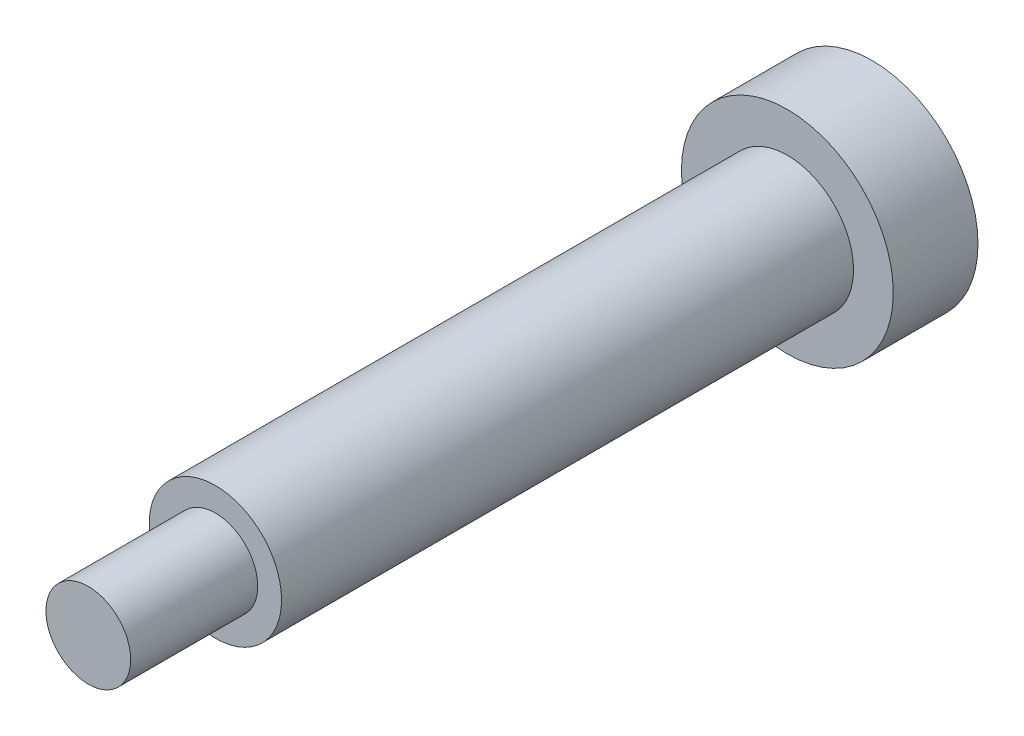
ISO-10303-21;
HEADER;
FILE_DESCRIPTION(('STEP AP214'),'2;1');
FILE_NAME('part.step','',(''),(''),'','','');
FILE_SCHEMA(('AUTOMOTIVE_DESIGN { 1 0 10303 214 1 1 1 1 }'));
ENDSEC;
DATA;
#1=APPLICATION_CONTEXT('core data for automotive mechanical design processes');
#2=APPLICATION_PROTOCOL_DEFINITION('international standard','automotive_design',2000,#1);
#3=PRODUCT_CONTEXT('',#1,'mechanical');
#4=PRODUCT('Part','Part','',(#3));
#5=PRODUCT_RELATED_PRODUCT_CATEGORY('part','',(#4));
#6=PRODUCT_DEFINITION_FORMATION('','',#4);
#7=PRODUCT_DEFINITION_CONTEXT('part definition',#1,'design');
#8=PRODUCT_DEFINITION('design','',#6,#7);
#9=PRODUCT_DEFINITION_SHAPE('','',#8);
#10=(LENGTH_UNIT() NAMED_UNIT(*) SI_UNIT(.MILLI.,.METRE.));
#11=(NAMED_UNIT(*) PLANE_ANGLE_UNIT() SI_UNIT($,.RADIAN.));
#12=(NAMED_UNIT(*) SI_UNIT($,.STERADIAN.) SOLID_ANGLE_UNIT());
#13=UNCERTAINTY_MEASURE_WITH_UNIT(LENGTH_MEASURE(1.E-05),#10,'distance_accuracy_value','');
#14=(GEOMETRIC_REPRESENTATION_CONTEXT(3) GLOBAL_UNCERTAINTY_ASSIGNED_CONTEXT((#13)) GLOBAL_UNIT_ASSIGNED_CONTEXT((#10,
#11,#12)) REPRESENTATION_CONTEXT('',''));
#15=CARTESIAN_POINT('',(0.,0.,0.));
#16=DIRECTION('',(0.,0.,1.));
#17=DIRECTION('',(1.,0.,0.));
#18=AXIS2_PLACEMENT_3D('',#15,#16,#17);
#19=CARTESIAN_POINT('',(0.,0.,4.));
#20=DIRECTION('',(0.,0.,-1.));
#21=DIRECTION('',(-1.,0.,0.));
#22=AXIS2_PLACEMENT_3D('',#19,#20,#21);
#23=CYLINDRICAL_SURFACE('',#22,5.);
#24=CARTESIAN_POINT('',(0.,0.,4.));
#25=DIRECTION('',(0.,0.,1.));
#26=DIRECTION('',(1.,0.,0.));
#27=AXIS2_PLACEMENT_3D('',#24,#25,#26);
#28=CIRCLE('',#27,5.);
#29=CARTESIAN_POINT('',(5.,0.,4.));
#30=VERTEX_POINT('',#29);
#31=EDGE_CURVE('E55',#30,#30,#28,.T.);
#32=ORIENTED_EDGE('',*,*,#31,.F.);
#33=EDGE_LOOP('',(#32));
#34=FACE_BOUND('',#33,.T.);
#35=CARTESIAN_POINT('',(0.,0.,0.));
#36=DIRECTION('',(0.,0.,1.));
#37=DIRECTION('',(1.,0.,0.));
#38=AXIS2_PLACEMENT_3D('',#35,#36,#37);
#39=CIRCLE('',#38,5.);
#40=CARTESIAN_POINT('',(5.,0.,0.));
#41=VERTEX_POINT('',#40);
#42=EDGE_CURVE('E44',#41,#41,#39,.T.);
#43=ORIENTED_EDGE('',*,*,#42,.T.);
#44=EDGE_LOOP('',(#43));
#45=FACE_BOUND('',#44,.T.);
#46=ADVANCED_FACE('F41',(#34,#45),#23,.T.);
#47=CARTESIAN_POINT('',(0.,0.,4.));
#48=DIRECTION('',(0.,0.,1.));
#49=DIRECTION('',(1.,0.,0.));
#50=AXIS2_PLACEMENT_3D('',#47,#48,#49);
#51=PLANE('',#50);
#52=CARTESIAN_POINT('',(0.,0.,4.));
#53=DIRECTION('',(0.,0.,1.));
#54=DIRECTION('',(1.,0.,0.));
#55=AXIS2_PLACEMENT_3D('',#52,#53,#54);
#56=CIRCLE('',#55,3.125);
#57=CARTESIAN_POINT('',(3.125,0.,4.));
#58=VERTEX_POINT('',#57);
#59=EDGE_CURVE('E49',#58,#58,#56,.T.);
#60=ORIENTED_EDGE('',*,*,#59,.F.);
#61=EDGE_LOOP('',(#60));
#62=FACE_BOUND('',#61,.T.);
#63=ORIENTED_EDGE('',*,*,#31,.T.);
#64=EDGE_LOOP('',(#63));
#65=FACE_BOUND('',#64,.T.);
#66=ADVANCED_FACE('F76',(#62,#65),#51,.T.);
#67=CARTESIAN_POINT('',(0.,0.,0.));
#68=DIRECTION('',(0.,0.,1.));
#69=DIRECTION('',(1.,0.,0.));
#70=AXIS2_PLACEMENT_3D('',#67,#68,#69);
#71=PLANE('',#70);
#72=ORIENTED_EDGE('',*,*,#42,.F.);
#73=EDGE_LOOP('',(#72));
#74=FACE_BOUND('',#73,.T.);
#75=ADVANCED_FACE('F73',(#74),#71,.F.);
#76=CARTESIAN_POINT('',(0.,0.,31.));
#77=DIRECTION('',(0.,0.,-1.));
#78=DIRECTION('',(-1.,0.,0.));
#79=AXIS2_PLACEMENT_3D('',#76,#77,#78);
#80=CYLINDRICAL_SURFACE('',#79,3.125);
#81=CARTESIAN_POINT('',(0.,0.,31.));
#82=DIRECTION('',(0.,0.,1.));
#83=DIRECTION('',(1.,0.,0.));
#84=AXIS2_PLACEMENT_3D('',#81,#82,#83);
#85=CIRCLE('',#84,3.125);
#86=CARTESIAN_POINT('',(3.125,0.,31.));
#87=VERTEX_POINT('',#86);
#88=EDGE_CURVE('E60',#87,#87,#85,.T.);
#89=ORIENTED_EDGE('',*,*,#88,.F.);
#90=EDGE_LOOP('',(#89));
#91=FACE_BOUND('',#90,.T.);
#92=ORIENTED_EDGE('',*,*,#59,.T.);
#93=EDGE_LOOP('',(#92));
#94=FACE_BOUND('',#93,.T.);
#95=ADVANCED_FACE('F75',(#91,#94),#80,.T.);
#96=CARTESIAN_POINT('',(0.,0.,31.));
#97=DIRECTION('',(0.,0.,1.));
#98=DIRECTION('',(1.,0.,0.));
#99=AXIS2_PLACEMENT_3D('',#96,#97,#98);
#100=PLANE('',#99);
#101=CARTESIAN_POINT('',(0.,0.,31.));
#102=DIRECTION('',(0.,0.,1.));
#103=DIRECTION('',(1.,0.,0.));
#104=AXIS2_PLACEMENT_3D('',#101,#102,#103);
#105=CIRCLE('',#104,2.);
#106=CARTESIAN_POINT('',(2.,0.,31.));
#107=VERTEX_POINT('',#106);
#108=EDGE_CURVE('E10',#107,#107,#105,.T.);
#109=ORIENTED_EDGE('',*,*,#108,.F.);
#110=EDGE_LOOP('',(#109));
#111=FACE_BOUND('',#110,.T.);
#112=ORIENTED_EDGE('',*,*,#88,.T.);
#113=EDGE_LOOP('',(#112));
#114=FACE_BOUND('',#113,.T.);
#115=ADVANCED_FACE('F80',(#111,#114),#100,.T.);
#116=CARTESIAN_POINT('',(0.,0.,37.));
#117=DIRECTION('',(0.,0.,-1.));
#118=DIRECTION('',(-1.,0.,0.));
#119=AXIS2_PLACEMENT_3D('',#116,#117,#118);
#120=CYLINDRICAL_SURFACE('',#119,2.);
#121=CARTESIAN_POINT('',(0.,0.,37.));
#122=DIRECTION('',(0.,0.,1.));
#123=DIRECTION('',(1.,0.,0.));
#124=AXIS2_PLACEMENT_3D('',#121,#122,#123);
#125=CIRCLE('',#124,2.);
#126=CARTESIAN_POINT('',(2.,0.,37.));
#127=VERTEX_POINT('',#126);
#128=EDGE_CURVE('E59',#127,#127,#125,.T.);
#129=ORIENTED_EDGE('',*,*,#128,.F.);
#130=EDGE_LOOP('',(#129));
#131=FACE_BOUND('',#130,.T.);
#132=ORIENTED_EDGE('',*,*,#108,.T.);
#133=EDGE_LOOP('',(#132));
#134=FACE_BOUND('',#133,.T.);
#135=ADVANCED_FACE('F109',(#131,#134),#120,.T.);
#136=CARTESIAN_POINT('',(0.,0.,37.));
#137=DIRECTION('',(0.,0.,1.));
#138=DIRECTION('',(1.,0.,0.));
#139=AXIS2_PLACEMENT_3D('',#136,#137,#138);
#140=PLANE('',#139);
#141=ORIENTED_EDGE('',*,*,#128,.T.);
#142=EDGE_LOOP('',(#141));
#143=FACE_BOUND('',#142,.T.);
#144=ADVANCED_FACE('F119',(#143),#140,.T.);
#145=CLOSED_SHELL('',(#46,#66,#75,#95,#115,#135,#144));
#146=MANIFOLD_SOLID_BREP('B2',#145);
#147=ADVANCED_BREP_SHAPE_REPRESENTATION('',(#18,#146),#14);
#148=SHAPE_DEFINITION_REPRESENTATION(#9,#147);
ENDSEC;
END-ISO-10303-21;
